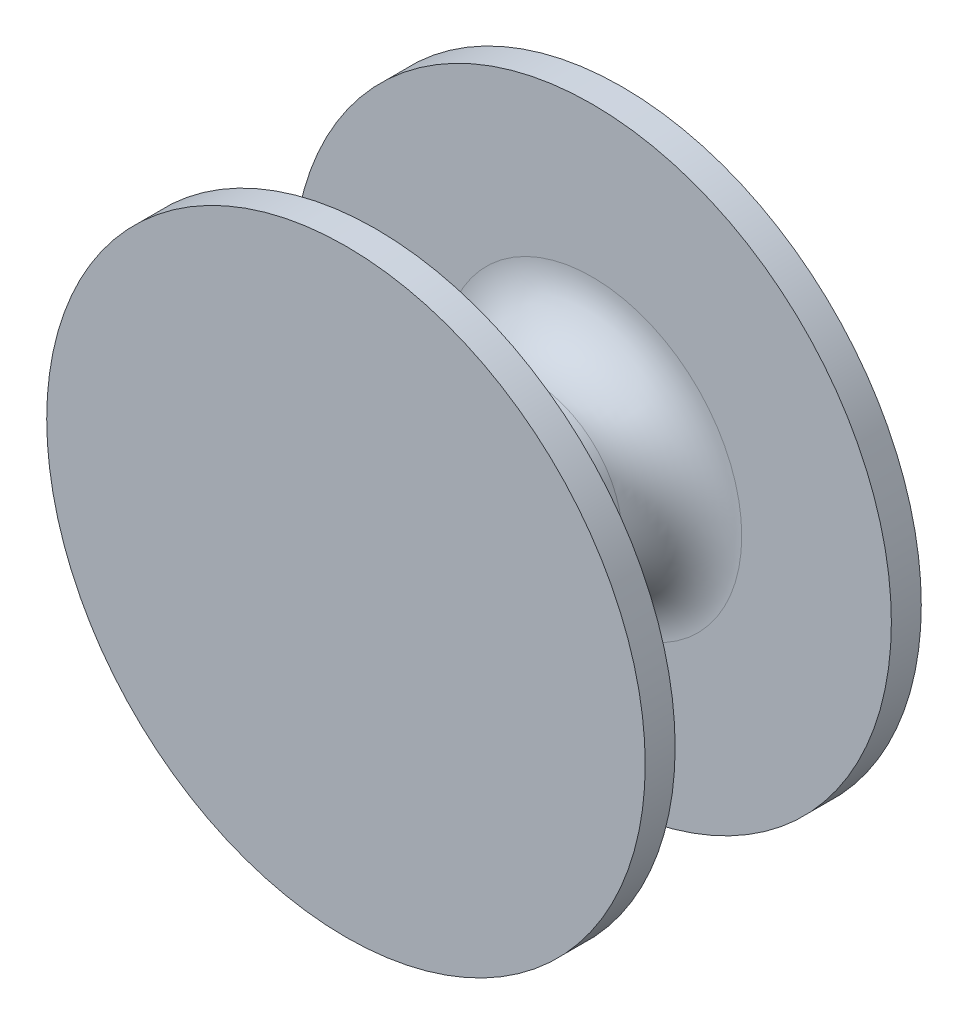
ISO-10303-21;
HEADER;
FILE_DESCRIPTION(('STEP AP214'),'2;1');
FILE_NAME('part.step','',(''),(''),'','','');
FILE_SCHEMA(('AUTOMOTIVE_DESIGN { 1 0 10303 214 1 1 1 1 }'));
ENDSEC;
DATA;
#1=APPLICATION_CONTEXT('core data for automotive mechanical design processes');
#2=APPLICATION_PROTOCOL_DEFINITION('international standard','automotive_design',2000,#1);
#3=PRODUCT_CONTEXT('',#1,'mechanical');
#4=PRODUCT('Part','Part','',(#3));
#5=PRODUCT_RELATED_PRODUCT_CATEGORY('part','',(#4));
#6=PRODUCT_DEFINITION_FORMATION('','',#4);
#7=PRODUCT_DEFINITION_CONTEXT('part definition',#1,'design');
#8=PRODUCT_DEFINITION('design','',#6,#7);
#9=PRODUCT_DEFINITION_SHAPE('','',#8);
#10=(LENGTH_UNIT() NAMED_UNIT(*) SI_UNIT(.MILLI.,.METRE.));
#11=(NAMED_UNIT(*) PLANE_ANGLE_UNIT() SI_UNIT($,.RADIAN.));
#12=(NAMED_UNIT(*) SI_UNIT($,.STERADIAN.) SOLID_ANGLE_UNIT());
#13=UNCERTAINTY_MEASURE_WITH_UNIT(LENGTH_MEASURE(1.E-05),#10,'distance_accuracy_value','');
#14=(GEOMETRIC_REPRESENTATION_CONTEXT(3) GLOBAL_UNCERTAINTY_ASSIGNED_CONTEXT((#13)) GLOBAL_UNIT_ASSIGNED_CONTEXT((#10,
#11,#12)) REPRESENTATION_CONTEXT('',''));
#15=CARTESIAN_POINT('',(0.,0.,0.));
#16=DIRECTION('',(0.,0.,1.));
#17=DIRECTION('',(1.,0.,0.));
#18=AXIS2_PLACEMENT_3D('',#15,#16,#17);
#19=CARTESIAN_POINT('',(0.,0.,2.30625));
#20=DIRECTION('',(0.,0.,-0.999999999999998));
#21=DIRECTION('',(-1.,0.,0.));
#22=AXIS2_PLACEMENT_3D('',#19,#20,#21);
#23=CYLINDRICAL_SURFACE('',#22,5.);
#24=CARTESIAN_POINT('',(0.,0.,2.30625));
#25=DIRECTION('',(0.,0.,0.999999999999998));
#26=DIRECTION('',(1.,0.,0.));
#27=AXIS2_PLACEMENT_3D('',#24,#25,#26);
#28=CIRCLE('',#27,5.);
#29=CARTESIAN_POINT('',(5.00000000000001,0.,2.30625));
#30=VERTEX_POINT('',#29);
#31=EDGE_CURVE('E67',#30,#30,#28,.T.);
#32=ORIENTED_EDGE('',*,*,#31,.F.);
#33=EDGE_LOOP('',(#32));
#34=FACE_BOUND('',#33,.T.);
#35=CARTESIAN_POINT('',(0.,0.,1.80625));
#36=DIRECTION('',(0.,0.,0.999999999999998));
#37=DIRECTION('',(1.,0.,0.));
#38=AXIS2_PLACEMENT_3D('',#35,#36,#37);
#39=CIRCLE('',#38,5.);
#40=CARTESIAN_POINT('',(5.00000000000001,0.,1.80625));
#41=VERTEX_POINT('',#40);
#42=EDGE_CURVE('E71',#41,#41,#39,.T.);
#43=ORIENTED_EDGE('',*,*,#42,.T.);
#44=EDGE_LOOP('',(#43));
#45=FACE_BOUND('',#44,.T.);
#46=ADVANCED_FACE('F47',(#34,#45),#23,.T.);
#47=CARTESIAN_POINT('',(0.,0.,2.30625));
#48=DIRECTION('',(0.,0.,0.999999999999998));
#49=DIRECTION('',(1.,0.,0.));
#50=AXIS2_PLACEMENT_3D('',#47,#48,#49);
#51=PLANE('',#50);
#52=ORIENTED_EDGE('',*,*,#31,.T.);
#53=EDGE_LOOP('',(#52));
#54=FACE_BOUND('',#53,.T.);
#55=ADVANCED_FACE('F96',(#54),#51,.T.);
#56=CARTESIAN_POINT('',(-5.,0.,1.80625));
#57=DIRECTION('',(0.,0.,-0.999999999999998));
#58=DIRECTION('',(-1.,0.,0.));
#59=AXIS2_PLACEMENT_3D('',#56,#57,#58);
#60=PLANE('',#59);
#61=CARTESIAN_POINT('',(0.,0.,1.80625));
#62=DIRECTION('',(0.,0.,-0.999999999999998));
#63=DIRECTION('',(-1.,0.,0.));
#64=AXIS2_PLACEMENT_3D('',#61,#62,#63);
#65=CIRCLE('',#64,2.5);
#66=CARTESIAN_POINT('',(-2.5,0.,1.80625));
#67=VERTEX_POINT('',#66);
#68=EDGE_CURVE('E12',#67,#67,#65,.F.);
#69=ORIENTED_EDGE('',*,*,#68,.T.);
#70=EDGE_LOOP('',(#69));
#71=FACE_BOUND('',#70,.T.);
#72=ORIENTED_EDGE('',*,*,#42,.F.);
#73=EDGE_LOOP('',(#72));
#74=FACE_BOUND('',#73,.T.);
#75=ADVANCED_FACE('F101',(#71,#74),#60,.T.);
#76=CARTESIAN_POINT('',(0.,0.,0.));
#77=DIRECTION('',(0.,0.,0.999999999999998));
#78=DIRECTION('',(1.,0.,0.));
#79=AXIS2_PLACEMENT_3D('',#76,#77,#78);
#80=CYLINDRICAL_SURFACE('',#79,1.5);
#81=CARTESIAN_POINT('',(0.,0.,-0.80625));
#82=DIRECTION('',(0.,0.,0.999999999999998));
#83=DIRECTION('',(1.,0.,0.));
#84=AXIS2_PLACEMENT_3D('',#81,#82,#83);
#85=CIRCLE('',#84,1.5);
#86=CARTESIAN_POINT('',(1.5,0.,-0.80625));
#87=VERTEX_POINT('',#86);
#88=EDGE_CURVE('E58',#87,#87,#85,.T.);
#89=ORIENTED_EDGE('',*,*,#88,.T.);
#90=EDGE_LOOP('',(#89));
#91=FACE_BOUND('',#90,.T.);
#92=CARTESIAN_POINT('',(0.,0.,0.80625));
#93=DIRECTION('',(0.,0.,-0.999999999999998));
#94=DIRECTION('',(-1.,0.,0.));
#95=AXIS2_PLACEMENT_3D('',#92,#93,#94);
#96=CIRCLE('',#95,1.5);
#97=CARTESIAN_POINT('',(-1.5,0.,0.80625));
#98=VERTEX_POINT('',#97);
#99=EDGE_CURVE('E62',#98,#98,#96,.T.);
#100=ORIENTED_EDGE('',*,*,#99,.T.);
#101=EDGE_LOOP('',(#100));
#102=FACE_BOUND('',#101,.T.);
#103=ADVANCED_FACE('F109',(#91,#102),#80,.T.);
#104=CARTESIAN_POINT('',(-4.99999999999999,0.,-1.80625));
#105=DIRECTION('',(0.,0.,0.999999999999998));
#106=DIRECTION('',(1.,0.,0.));
#107=AXIS2_PLACEMENT_3D('',#104,#105,#106);
#108=PLANE('',#107);
#109=CARTESIAN_POINT('',(0.,0.,-1.80625));
#110=DIRECTION('',(0.,0.,0.999999999999998));
#111=DIRECTION('',(1.,0.,0.));
#112=AXIS2_PLACEMENT_3D('',#109,#110,#111);
#113=CIRCLE('',#112,2.5);
#114=CARTESIAN_POINT('',(2.5,0.,-1.80625));
#115=VERTEX_POINT('',#114);
#116=EDGE_CURVE('E54',#115,#115,#113,.F.);
#117=ORIENTED_EDGE('',*,*,#116,.T.);
#118=EDGE_LOOP('',(#117));
#119=FACE_BOUND('',#118,.T.);
#120=CARTESIAN_POINT('',(0.,0.,-1.80625));
#121=DIRECTION('',(0.,0.,0.999999999999998));
#122=DIRECTION('',(1.,0.,0.));
#123=AXIS2_PLACEMENT_3D('',#120,#121,#122);
#124=CIRCLE('',#123,5.);
#125=CARTESIAN_POINT('',(5.00000000000001,0.,-1.80625));
#126=VERTEX_POINT('',#125);
#127=EDGE_CURVE('E76',#126,#126,#124,.T.);
#128=ORIENTED_EDGE('',*,*,#127,.T.);
#129=EDGE_LOOP('',(#128));
#130=FACE_BOUND('',#129,.T.);
#131=ADVANCED_FACE('F80',(#119,#130),#108,.T.);
#132=CARTESIAN_POINT('',(0.,0.,-2.30625));
#133=DIRECTION('',(0.,0.,0.999999999999998));
#134=DIRECTION('',(1.,0.,0.));
#135=AXIS2_PLACEMENT_3D('',#132,#133,#134);
#136=PLANE('',#135);
#137=CARTESIAN_POINT('',(0.,0.,-2.30625));
#138=DIRECTION('',(0.,0.,0.999999999999998));
#139=DIRECTION('',(1.,0.,0.));
#140=AXIS2_PLACEMENT_3D('',#137,#138,#139);
#141=CIRCLE('',#140,5.);
#142=CARTESIAN_POINT('',(5.00000000000001,0.,-2.30625));
#143=VERTEX_POINT('',#142);
#144=EDGE_CURVE('E68',#143,#143,#141,.T.);
#145=ORIENTED_EDGE('',*,*,#144,.F.);
#146=EDGE_LOOP('',(#145));
#147=FACE_BOUND('',#146,.T.);
#148=ADVANCED_FACE('F85',(#147),#136,.F.);
#149=ORIENTED_EDGE('',*,*,#144,.T.);
#150=EDGE_LOOP('',(#149));
#151=FACE_BOUND('',#150,.T.);
#152=ORIENTED_EDGE('',*,*,#127,.F.);
#153=EDGE_LOOP('',(#152));
#154=FACE_BOUND('',#153,.T.);
#155=ADVANCED_FACE('F82',(#151,#154),#23,.T.);
#156=CARTESIAN_POINT('',(0.,0.,-0.80625));
#157=DIRECTION('',(0.,0.,0.999999999999998));
#158=DIRECTION('',(1.,0.,0.));
#159=AXIS2_PLACEMENT_3D('',#156,#157,#158);
#160=TOROIDAL_SURFACE('',#159,2.5,1.);
#161=ORIENTED_EDGE('',*,*,#116,.F.);
#162=EDGE_LOOP('',(#161));
#163=FACE_BOUND('',#162,.T.);
#164=ORIENTED_EDGE('',*,*,#88,.F.);
#165=EDGE_LOOP('',(#164));
#166=FACE_BOUND('',#165,.T.);
#167=ADVANCED_FACE('F84',(#163,#166),#160,.F.);
#168=CARTESIAN_POINT('',(0.,0.,0.80625));
#169=DIRECTION('',(0.,0.,-0.999999999999998));
#170=DIRECTION('',(-1.,0.,0.));
#171=AXIS2_PLACEMENT_3D('',#168,#169,#170);
#172=TOROIDAL_SURFACE('',#171,2.5,1.);
#173=ORIENTED_EDGE('',*,*,#99,.F.);
#174=EDGE_LOOP('',(#173));
#175=FACE_BOUND('',#174,.T.);
#176=ORIENTED_EDGE('',*,*,#68,.F.);
#177=EDGE_LOOP('',(#176));
#178=FACE_BOUND('',#177,.T.);
#179=ADVANCED_FACE('F49',(#175,#178),#172,.F.);
#180=CLOSED_SHELL('',(#46,#55,#75,#103,#131,#148,#155,#167,#179));
#181=MANIFOLD_SOLID_BREP('B2',#180);
#182=ADVANCED_BREP_SHAPE_REPRESENTATION('',(#18,#181),#14);
#183=SHAPE_DEFINITION_REPRESENTATION(#9,#182);
ENDSEC;
END-ISO-10303-21;
